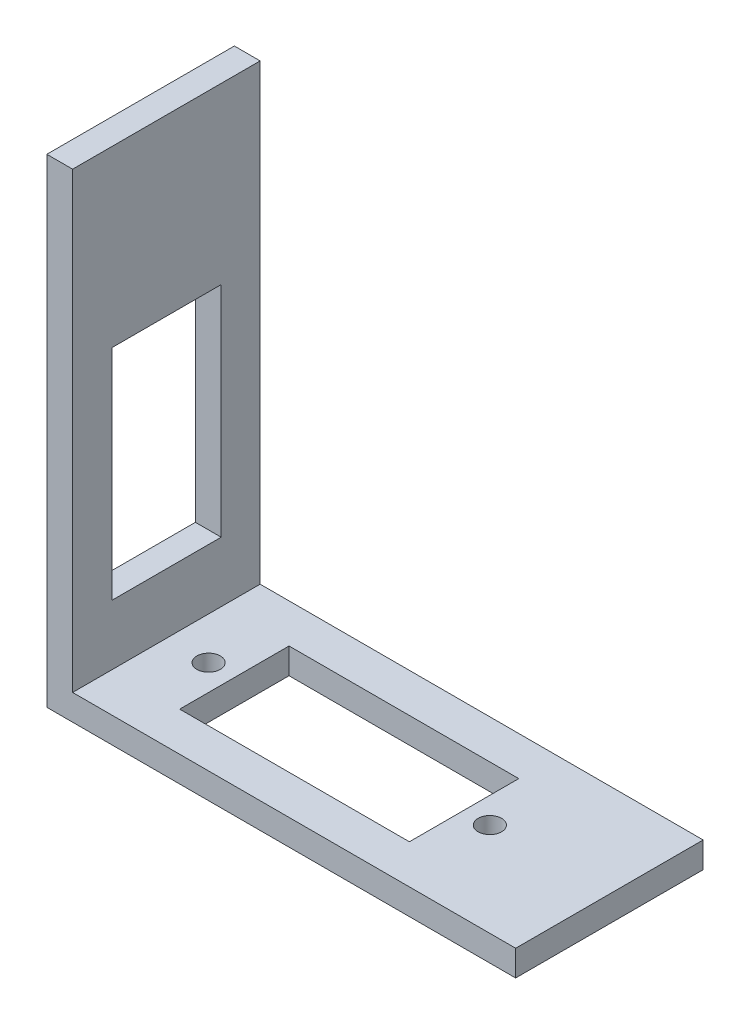
ISO-10303-21;
HEADER;
FILE_DESCRIPTION(('STEP AP214'),'2;1');
FILE_NAME('part.step','',(''),(''),'','','');
FILE_SCHEMA(('AUTOMOTIVE_DESIGN { 1 0 10303 214 1 1 1 1 }'));
ENDSEC;
DATA;
#1=APPLICATION_CONTEXT('core data for automotive mechanical design processes');
#2=APPLICATION_PROTOCOL_DEFINITION('international standard','automotive_design',2000,#1);
#3=PRODUCT_CONTEXT('',#1,'mechanical');
#4=PRODUCT('Part','Part','',(#3));
#5=PRODUCT_RELATED_PRODUCT_CATEGORY('part','',(#4));
#6=PRODUCT_DEFINITION_FORMATION('','',#4);
#7=PRODUCT_DEFINITION_CONTEXT('part definition',#1,'design');
#8=PRODUCT_DEFINITION('design','',#6,#7);
#9=PRODUCT_DEFINITION_SHAPE('','',#8);
#10=(LENGTH_UNIT() NAMED_UNIT(*) SI_UNIT(.MILLI.,.METRE.));
#11=(NAMED_UNIT(*) PLANE_ANGLE_UNIT() SI_UNIT($,.RADIAN.));
#12=(NAMED_UNIT(*) SI_UNIT($,.STERADIAN.) SOLID_ANGLE_UNIT());
#13=UNCERTAINTY_MEASURE_WITH_UNIT(LENGTH_MEASURE(1.E-05),#10,'distance_accuracy_value','');
#14=(GEOMETRIC_REPRESENTATION_CONTEXT(3) GLOBAL_UNCERTAINTY_ASSIGNED_CONTEXT((#13)) GLOBAL_UNIT_ASSIGNED_CONTEXT((#10,
#11,#12)) REPRESENTATION_CONTEXT('',''));
#15=CARTESIAN_POINT('',(0.,0.,0.));
#16=DIRECTION('',(0.,0.,1.));
#17=DIRECTION('',(1.,0.,0.));
#18=AXIS2_PLACEMENT_3D('',#15,#16,#17);
#19=CARTESIAN_POINT('',(0.,3.3,0.));
#20=DIRECTION('',(0.,-1.,0.));
#21=DIRECTION('',(0.,0.,-1.));
#22=AXIS2_PLACEMENT_3D('',#19,#20,#21);
#23=PLANE('',#22);
#24=DIRECTION('',(0.,0.,-1.));
#25=VECTOR('',#24,1.);
#26=CARTESIAN_POINT('',(-26.7,3.3,0.));
#27=LINE('',#26,#25);
#28=CARTESIAN_POINT('',(-26.7,3.3,12.));
#29=VERTEX_POINT('',#28);
#30=CARTESIAN_POINT('',(-26.7,3.3,-12.));
#31=VERTEX_POINT('',#30);
#32=EDGE_CURVE('E223',#29,#31,#27,.T.);
#33=ORIENTED_EDGE('',*,*,#32,.F.);
#34=DIRECTION('',(1.,0.,0.));
#35=VECTOR('',#34,1.);
#36=CARTESIAN_POINT('',(-30.,3.3,12.));
#37=LINE('',#36,#35);
#38=CARTESIAN_POINT('',(30.,3.3,12.));
#39=VERTEX_POINT('',#38);
#40=EDGE_CURVE('E233',#29,#39,#37,.T.);
#41=ORIENTED_EDGE('',*,*,#40,.T.);
#42=DIRECTION('',(0.,0.,-1.));
#43=VECTOR('',#42,1.);
#44=CARTESIAN_POINT('',(30.,3.3,12.));
#45=LINE('',#44,#43);
#46=CARTESIAN_POINT('',(30.,3.3,-12.));
#47=VERTEX_POINT('',#46);
#48=EDGE_CURVE('E227',#39,#47,#45,.T.);
#49=ORIENTED_EDGE('',*,*,#48,.T.);
#50=DIRECTION('',(-1.,0.,0.));
#51=VECTOR('',#50,1.);
#52=CARTESIAN_POINT('',(-30.,3.3,-12.));
#53=LINE('',#52,#51);
#54=EDGE_CURVE('E230',#47,#31,#53,.T.);
#55=ORIENTED_EDGE('',*,*,#54,.T.);
#56=EDGE_LOOP('',(#33,#41,#49,#55));
#57=FACE_BOUND('',#56,.T.);
#58=DIRECTION('',(1.,0.,0.));
#59=VECTOR('',#58,1.);
#60=CARTESIAN_POINT('',(11.4,3.3,-7.00000000000001));
#61=LINE('',#60,#59);
#62=CARTESIAN_POINT('',(-18.,3.3,-7.));
#63=VERTEX_POINT('',#62);
#64=CARTESIAN_POINT('',(11.4,3.3,-7.00000000000001));
#65=VERTEX_POINT('',#64);
#66=EDGE_CURVE('E179',#63,#65,#61,.T.);
#67=ORIENTED_EDGE('',*,*,#66,.T.);
#68=DIRECTION('',(0.,0.,1.));
#69=VECTOR('',#68,1.);
#70=CARTESIAN_POINT('',(11.4,3.3,-7.00000000000001));
#71=LINE('',#70,#69);
#72=CARTESIAN_POINT('',(11.4,3.3,6.99999999999999));
#73=VERTEX_POINT('',#72);
#74=EDGE_CURVE('E175',#65,#73,#71,.T.);
#75=ORIENTED_EDGE('',*,*,#74,.T.);
#76=DIRECTION('',(-1.,0.,0.));
#77=VECTOR('',#76,1.);
#78=CARTESIAN_POINT('',(11.4,3.3,6.99999999999999));
#79=LINE('',#78,#77);
#80=CARTESIAN_POINT('',(-18.,3.3,7.));
#81=VERTEX_POINT('',#80);
#82=EDGE_CURVE('E178',#73,#81,#79,.T.);
#83=ORIENTED_EDGE('',*,*,#82,.T.);
#84=DIRECTION('',(0.,0.,-1.));
#85=VECTOR('',#84,1.);
#86=CARTESIAN_POINT('',(-18.,3.3,-7.));
#87=LINE('',#86,#85);
#88=EDGE_CURVE('E182',#81,#63,#87,.T.);
#89=ORIENTED_EDGE('',*,*,#88,.T.);
#90=EDGE_LOOP('',(#67,#75,#83,#89));
#91=FACE_BOUND('',#90,.T.);
#92=CARTESIAN_POINT('',(-21.3,3.3,0.));
#93=DIRECTION('',(0.,-1.,0.));
#94=DIRECTION('',(0.,0.,-1.));
#95=AXIS2_PLACEMENT_3D('',#92,#93,#94);
#96=CIRCLE('',#95,1.5);
#97=CARTESIAN_POINT('',(-21.3,3.3,-1.5));
#98=VERTEX_POINT('',#97);
#99=EDGE_CURVE('E171',#98,#98,#96,.T.);
#100=ORIENTED_EDGE('',*,*,#99,.T.);
#101=EDGE_LOOP('',(#100));
#102=FACE_BOUND('',#101,.T.);
#103=CARTESIAN_POINT('',(14.7,3.3,0.));
#104=DIRECTION('',(0.,-1.,0.));
#105=DIRECTION('',(0.,0.,-1.));
#106=AXIS2_PLACEMENT_3D('',#103,#104,#105);
#107=CIRCLE('',#106,1.5);
#108=CARTESIAN_POINT('',(14.7,3.3,-1.50000000000001));
#109=VERTEX_POINT('',#108);
#110=EDGE_CURVE('E165',#109,#109,#107,.T.);
#111=ORIENTED_EDGE('',*,*,#110,.T.);
#112=EDGE_LOOP('',(#111));
#113=FACE_BOUND('',#112,.T.);
#114=ADVANCED_FACE('F33',(#57,#91,#102,#113),#23,.F.);
#115=CARTESIAN_POINT('',(0.,0.,0.));
#116=DIRECTION('',(0.,-1.,0.));
#117=DIRECTION('',(0.,0.,-1.));
#118=AXIS2_PLACEMENT_3D('',#115,#116,#117);
#119=PLANE('',#118);
#120=CARTESIAN_POINT('',(-21.3,0.,0.));
#121=DIRECTION('',(0.,1.,0.));
#122=DIRECTION('',(0.,0.,1.));
#123=AXIS2_PLACEMENT_3D('',#120,#121,#122);
#124=CIRCLE('',#123,1.5);
#125=CARTESIAN_POINT('',(-21.3,0.,1.5));
#126=VERTEX_POINT('',#125);
#127=EDGE_CURVE('E168',#126,#126,#124,.T.);
#128=ORIENTED_EDGE('',*,*,#127,.T.);
#129=EDGE_LOOP('',(#128));
#130=FACE_BOUND('',#129,.T.);
#131=DIRECTION('',(0.,0.,1.));
#132=VECTOR('',#131,1.);
#133=CARTESIAN_POINT('',(-30.,0.,12.));
#134=LINE('',#133,#132);
#135=CARTESIAN_POINT('',(-30.,0.,-12.));
#136=VERTEX_POINT('',#135);
#137=CARTESIAN_POINT('',(-30.,0.,12.));
#138=VERTEX_POINT('',#137);
#139=EDGE_CURVE('E240',#136,#138,#134,.T.);
#140=ORIENTED_EDGE('',*,*,#139,.F.);
#141=DIRECTION('',(-1.,0.,0.));
#142=VECTOR('',#141,1.);
#143=CARTESIAN_POINT('',(-30.,0.,-12.));
#144=LINE('',#143,#142);
#145=CARTESIAN_POINT('',(30.,0.,-12.));
#146=VERTEX_POINT('',#145);
#147=EDGE_CURVE('E238',#146,#136,#144,.T.);
#148=ORIENTED_EDGE('',*,*,#147,.F.);
#149=DIRECTION('',(0.,0.,-1.));
#150=VECTOR('',#149,1.);
#151=CARTESIAN_POINT('',(30.,0.,12.));
#152=LINE('',#151,#150);
#153=CARTESIAN_POINT('',(30.,0.,12.));
#154=VERTEX_POINT('',#153);
#155=EDGE_CURVE('E226',#154,#146,#152,.T.);
#156=ORIENTED_EDGE('',*,*,#155,.F.);
#157=DIRECTION('',(1.,0.,0.));
#158=VECTOR('',#157,1.);
#159=CARTESIAN_POINT('',(-30.,0.,12.));
#160=LINE('',#159,#158);
#161=EDGE_CURVE('E231',#138,#154,#160,.T.);
#162=ORIENTED_EDGE('',*,*,#161,.F.);
#163=EDGE_LOOP('',(#140,#148,#156,#162));
#164=FACE_BOUND('',#163,.T.);
#165=DIRECTION('',(0.,0.,-1.));
#166=VECTOR('',#165,1.);
#167=CARTESIAN_POINT('',(11.4,0.,-7.00000000000001));
#168=LINE('',#167,#166);
#169=CARTESIAN_POINT('',(11.4,0.,6.99999999999999));
#170=VERTEX_POINT('',#169);
#171=CARTESIAN_POINT('',(11.4,0.,-7.00000000000001));
#172=VERTEX_POINT('',#171);
#173=EDGE_CURVE('E191',#170,#172,#168,.T.);
#174=ORIENTED_EDGE('',*,*,#173,.T.);
#175=DIRECTION('',(-1.,0.,0.));
#176=VECTOR('',#175,1.);
#177=CARTESIAN_POINT('',(11.4,0.,-7.00000000000001));
#178=LINE('',#177,#176);
#179=CARTESIAN_POINT('',(-18.,0.,-7.));
#180=VERTEX_POINT('',#179);
#181=EDGE_CURVE('E194',#172,#180,#178,.T.);
#182=ORIENTED_EDGE('',*,*,#181,.T.);
#183=DIRECTION('',(0.,0.,1.));
#184=VECTOR('',#183,1.);
#185=CARTESIAN_POINT('',(-18.,0.,-7.));
#186=LINE('',#185,#184);
#187=CARTESIAN_POINT('',(-18.,0.,7.));
#188=VERTEX_POINT('',#187);
#189=EDGE_CURVE('E174',#180,#188,#186,.T.);
#190=ORIENTED_EDGE('',*,*,#189,.T.);
#191=DIRECTION('',(1.,0.,0.));
#192=VECTOR('',#191,1.);
#193=CARTESIAN_POINT('',(11.4,0.,6.99999999999999));
#194=LINE('',#193,#192);
#195=EDGE_CURVE('E188',#188,#170,#194,.T.);
#196=ORIENTED_EDGE('',*,*,#195,.T.);
#197=EDGE_LOOP('',(#174,#182,#190,#196));
#198=FACE_BOUND('',#197,.T.);
#199=CARTESIAN_POINT('',(14.7,0.,0.));
#200=DIRECTION('',(0.,1.,0.));
#201=DIRECTION('',(0.,0.,-1.));
#202=AXIS2_PLACEMENT_3D('',#199,#200,#201);
#203=CIRCLE('',#202,1.5);
#204=CARTESIAN_POINT('',(14.7,0.,-1.50000000000001));
#205=VERTEX_POINT('',#204);
#206=EDGE_CURVE('E160',#205,#205,#203,.T.);
#207=ORIENTED_EDGE('',*,*,#206,.T.);
#208=EDGE_LOOP('',(#207));
#209=FACE_BOUND('',#208,.T.);
#210=ADVANCED_FACE('F277',(#130,#164,#198,#209),#119,.T.);
#211=CARTESIAN_POINT('',(30.,3.3,12.));
#212=DIRECTION('',(-1.,0.,0.));
#213=DIRECTION('',(0.,0.,1.));
#214=AXIS2_PLACEMENT_3D('',#211,#212,#213);
#215=PLANE('',#214);
#216=ORIENTED_EDGE('',*,*,#155,.T.);
#217=DIRECTION('',(0.,-1.,0.));
#218=VECTOR('',#217,1.);
#219=CARTESIAN_POINT('',(30.,3.3,-12.));
#220=LINE('',#219,#218);
#221=EDGE_CURVE('E251',#47,#146,#220,.T.);
#222=ORIENTED_EDGE('',*,*,#221,.F.);
#223=ORIENTED_EDGE('',*,*,#48,.F.);
#224=DIRECTION('',(0.,-1.,0.));
#225=VECTOR('',#224,1.);
#226=CARTESIAN_POINT('',(30.,3.3,12.));
#227=LINE('',#226,#225);
#228=EDGE_CURVE('E235',#39,#154,#227,.T.);
#229=ORIENTED_EDGE('',*,*,#228,.T.);
#230=EDGE_LOOP('',(#216,#222,#223,#229));
#231=FACE_BOUND('',#230,.T.);
#232=ADVANCED_FACE('F35',(#231),#215,.F.);
#233=CARTESIAN_POINT('',(-30.,3.3,-12.));
#234=DIRECTION('',(0.,0.,1.));
#235=DIRECTION('',(1.,0.,0.));
#236=AXIS2_PLACEMENT_3D('',#233,#234,#235);
#237=PLANE('',#236);
#238=DIRECTION('',(0.,-1.,0.));
#239=VECTOR('',#238,1.);
#240=CARTESIAN_POINT('',(-30.,3.3,-12.));
#241=LINE('',#240,#239);
#242=CARTESIAN_POINT('',(-30.,61.3,-12.));
#243=VERTEX_POINT('',#242);
#244=EDGE_CURVE('E248',#243,#136,#241,.T.);
#245=ORIENTED_EDGE('',*,*,#244,.F.);
#246=DIRECTION('',(-1.,0.,0.));
#247=VECTOR('',#246,1.);
#248=CARTESIAN_POINT('',(-26.7,61.3,-12.));
#249=LINE('',#248,#247);
#250=CARTESIAN_POINT('',(-26.7,61.3,-12.));
#251=VERTEX_POINT('',#250);
#252=EDGE_CURVE('E185',#251,#243,#249,.T.);
#253=ORIENTED_EDGE('',*,*,#252,.F.);
#254=DIRECTION('',(0.,-1.,0.));
#255=VECTOR('',#254,1.);
#256=CARTESIAN_POINT('',(-26.7,61.3,-12.));
#257=LINE('',#256,#255);
#258=EDGE_CURVE('E217',#251,#31,#257,.T.);
#259=ORIENTED_EDGE('',*,*,#258,.T.);
#260=ORIENTED_EDGE('',*,*,#54,.F.);
#261=ORIENTED_EDGE('',*,*,#221,.T.);
#262=ORIENTED_EDGE('',*,*,#147,.T.);
#263=EDGE_LOOP('',(#245,#253,#259,#260,#261,#262));
#264=FACE_BOUND('',#263,.T.);
#265=ADVANCED_FACE('F294',(#264),#237,.F.);
#266=CARTESIAN_POINT('',(-30.,3.3,12.));
#267=DIRECTION('',(1.,0.,0.));
#268=DIRECTION('',(0.,0.,-1.));
#269=AXIS2_PLACEMENT_3D('',#266,#267,#268);
#270=PLANE('',#269);
#271=DIRECTION('',(0.,0.,1.));
#272=VECTOR('',#271,1.);
#273=CARTESIAN_POINT('',(-30.,11.,6.9872059416074));
#274=LINE('',#273,#272);
#275=CARTESIAN_POINT('',(-30.,11.,-7.0127940583926));
#276=VERTEX_POINT('',#275);
#277=CARTESIAN_POINT('',(-30.,11.,6.9872059416074));
#278=VERTEX_POINT('',#277);
#279=EDGE_CURVE('E146',#276,#278,#274,.T.);
#280=ORIENTED_EDGE('',*,*,#279,.F.);
#281=DIRECTION('',(0.,-1.,0.));
#282=VECTOR('',#281,1.);
#283=CARTESIAN_POINT('',(-30.,11.,-7.0127940583926));
#284=LINE('',#283,#282);
#285=CARTESIAN_POINT('',(-30.,39.,-7.0127940583926));
#286=VERTEX_POINT('',#285);
#287=EDGE_CURVE('E48',#286,#276,#284,.T.);
#288=ORIENTED_EDGE('',*,*,#287,.F.);
#289=DIRECTION('',(0.,0.,-1.));
#290=VECTOR('',#289,1.);
#291=CARTESIAN_POINT('',(-30.,39.,6.9872059416074));
#292=LINE('',#291,#290);
#293=CARTESIAN_POINT('',(-30.,39.,6.9872059416074));
#294=VERTEX_POINT('',#293);
#295=EDGE_CURVE('E153',#294,#286,#292,.T.);
#296=ORIENTED_EDGE('',*,*,#295,.F.);
#297=DIRECTION('',(0.,1.,0.));
#298=VECTOR('',#297,1.);
#299=CARTESIAN_POINT('',(-30.,11.,6.9872059416074));
#300=LINE('',#299,#298);
#301=EDGE_CURVE('E137',#278,#294,#300,.T.);
#302=ORIENTED_EDGE('',*,*,#301,.F.);
#303=EDGE_LOOP('',(#280,#288,#296,#302));
#304=FACE_BOUND('',#303,.T.);
#305=ORIENTED_EDGE('',*,*,#139,.T.);
#306=DIRECTION('',(0.,-1.,0.));
#307=VECTOR('',#306,1.);
#308=CARTESIAN_POINT('',(-30.,3.3,12.));
#309=LINE('',#308,#307);
#310=CARTESIAN_POINT('',(-30.,61.3,12.));
#311=VERTEX_POINT('',#310);
#312=EDGE_CURVE('E245',#311,#138,#309,.T.);
#313=ORIENTED_EDGE('',*,*,#312,.F.);
#314=DIRECTION('',(0.,0.,1.));
#315=VECTOR('',#314,1.);
#316=CARTESIAN_POINT('',(-30.,61.3,-12.));
#317=LINE('',#316,#315);
#318=EDGE_CURVE('E210',#243,#311,#317,.T.);
#319=ORIENTED_EDGE('',*,*,#318,.F.);
#320=ORIENTED_EDGE('',*,*,#244,.T.);
#321=EDGE_LOOP('',(#305,#313,#319,#320));
#322=FACE_BOUND('',#321,.T.);
#323=ADVANCED_FACE('F150',(#304,#322),#270,.F.);
#324=CARTESIAN_POINT('',(-30.,3.3,12.));
#325=DIRECTION('',(0.,0.,-1.));
#326=DIRECTION('',(-1.,0.,0.));
#327=AXIS2_PLACEMENT_3D('',#324,#325,#326);
#328=PLANE('',#327);
#329=ORIENTED_EDGE('',*,*,#161,.T.);
#330=ORIENTED_EDGE('',*,*,#228,.F.);
#331=ORIENTED_EDGE('',*,*,#40,.F.);
#332=DIRECTION('',(0.,-1.,0.));
#333=VECTOR('',#332,1.);
#334=CARTESIAN_POINT('',(-26.7,61.3,12.));
#335=LINE('',#334,#333);
#336=CARTESIAN_POINT('',(-26.7,61.3,12.));
#337=VERTEX_POINT('',#336);
#338=EDGE_CURVE('E220',#337,#29,#335,.T.);
#339=ORIENTED_EDGE('',*,*,#338,.F.);
#340=DIRECTION('',(1.,0.,0.));
#341=VECTOR('',#340,1.);
#342=CARTESIAN_POINT('',(-30.,61.3,12.));
#343=LINE('',#342,#341);
#344=EDGE_CURVE('E213',#311,#337,#343,.T.);
#345=ORIENTED_EDGE('',*,*,#344,.F.);
#346=ORIENTED_EDGE('',*,*,#312,.T.);
#347=EDGE_LOOP('',(#329,#330,#331,#339,#345,#346));
#348=FACE_BOUND('',#347,.T.);
#349=ADVANCED_FACE('F289',(#348),#328,.F.);
#350=CARTESIAN_POINT('',(-26.7,61.3,12.));
#351=DIRECTION('',(-1.,0.,0.));
#352=DIRECTION('',(0.,0.,1.));
#353=AXIS2_PLACEMENT_3D('',#350,#351,#352);
#354=PLANE('',#353);
#355=DIRECTION('',(0.,0.,-1.));
#356=VECTOR('',#355,1.);
#357=CARTESIAN_POINT('',(-26.7,39.,12.));
#358=LINE('',#357,#356);
#359=CARTESIAN_POINT('',(-26.7,39.,6.9872059416074));
#360=VERTEX_POINT('',#359);
#361=CARTESIAN_POINT('',(-26.7,39.,-7.0127940583926));
#362=VERTEX_POINT('',#361);
#363=EDGE_CURVE('E41',#360,#362,#358,.T.);
#364=ORIENTED_EDGE('',*,*,#363,.T.);
#365=DIRECTION('',(0.,-1.,0.));
#366=VECTOR('',#365,1.);
#367=CARTESIAN_POINT('',(-26.7,61.3,-7.0127940583926));
#368=LINE('',#367,#366);
#369=CARTESIAN_POINT('',(-26.7,11.,-7.0127940583926));
#370=VERTEX_POINT('',#369);
#371=EDGE_CURVE('E11',#362,#370,#368,.T.);
#372=ORIENTED_EDGE('',*,*,#371,.T.);
#373=DIRECTION('',(0.,0.,1.));
#374=VECTOR('',#373,1.);
#375=CARTESIAN_POINT('',(-26.7,11.,12.));
#376=LINE('',#375,#374);
#377=CARTESIAN_POINT('',(-26.7,11.,6.9872059416074));
#378=VERTEX_POINT('',#377);
#379=EDGE_CURVE('E254',#370,#378,#376,.T.);
#380=ORIENTED_EDGE('',*,*,#379,.T.);
#381=DIRECTION('',(0.,1.,0.));
#382=VECTOR('',#381,1.);
#383=CARTESIAN_POINT('',(-26.7,61.3,6.9872059416074));
#384=LINE('',#383,#382);
#385=EDGE_CURVE('E140',#378,#360,#384,.T.);
#386=ORIENTED_EDGE('',*,*,#385,.T.);
#387=EDGE_LOOP('',(#364,#372,#380,#386));
#388=FACE_BOUND('',#387,.T.);
#389=ORIENTED_EDGE('',*,*,#338,.T.);
#390=ORIENTED_EDGE('',*,*,#32,.T.);
#391=ORIENTED_EDGE('',*,*,#258,.F.);
#392=DIRECTION('',(0.,0.,-1.));
#393=VECTOR('',#392,1.);
#394=CARTESIAN_POINT('',(-26.7,61.3,12.));
#395=LINE('',#394,#393);
#396=EDGE_CURVE('E215',#337,#251,#395,.T.);
#397=ORIENTED_EDGE('',*,*,#396,.F.);
#398=EDGE_LOOP('',(#389,#390,#391,#397));
#399=FACE_BOUND('',#398,.T.);
#400=ADVANCED_FACE('F258',(#388,#399),#354,.F.);
#401=CARTESIAN_POINT('',(0.,61.3,0.));
#402=DIRECTION('',(0.,1.,0.));
#403=DIRECTION('',(0.,0.,1.));
#404=AXIS2_PLACEMENT_3D('',#401,#402,#403);
#405=PLANE('',#404);
#406=ORIENTED_EDGE('',*,*,#252,.T.);
#407=ORIENTED_EDGE('',*,*,#318,.T.);
#408=ORIENTED_EDGE('',*,*,#344,.T.);
#409=ORIENTED_EDGE('',*,*,#396,.T.);
#410=EDGE_LOOP('',(#406,#407,#408,#409));
#411=FACE_BOUND('',#410,.T.);
#412=ADVANCED_FACE('F306',(#411),#405,.T.);
#413=CARTESIAN_POINT('',(11.4,35.8631693789164,-7.00000000000001));
#414=DIRECTION('',(0.,0.,1.));
#415=DIRECTION('',(1.,0.,0.));
#416=AXIS2_PLACEMENT_3D('',#413,#414,#415);
#417=PLANE('',#416);
#418=DIRECTION('',(0.,-1.,0.));
#419=VECTOR('',#418,1.);
#420=CARTESIAN_POINT('',(-18.,35.8631693789164,-7.));
#421=LINE('',#420,#419);
#422=EDGE_CURVE('E197',#63,#180,#421,.T.);
#423=ORIENTED_EDGE('',*,*,#422,.T.);
#424=ORIENTED_EDGE('',*,*,#181,.F.);
#425=DIRECTION('',(0.,-1.,0.));
#426=VECTOR('',#425,1.);
#427=CARTESIAN_POINT('',(11.4,35.8631693789164,-7.00000000000001));
#428=LINE('',#427,#426);
#429=EDGE_CURVE('E199',#65,#172,#428,.T.);
#430=ORIENTED_EDGE('',*,*,#429,.F.);
#431=ORIENTED_EDGE('',*,*,#66,.F.);
#432=EDGE_LOOP('',(#423,#424,#430,#431));
#433=FACE_BOUND('',#432,.T.);
#434=ADVANCED_FACE('F329',(#433),#417,.T.);
#435=CARTESIAN_POINT('',(11.4,35.8631693789164,-7.00000000000001));
#436=DIRECTION('',(-1.,0.,0.));
#437=DIRECTION('',(0.,0.,1.));
#438=AXIS2_PLACEMENT_3D('',#435,#436,#437);
#439=PLANE('',#438);
#440=ORIENTED_EDGE('',*,*,#429,.T.);
#441=ORIENTED_EDGE('',*,*,#173,.F.);
#442=DIRECTION('',(0.,-1.,0.));
#443=VECTOR('',#442,1.);
#444=CARTESIAN_POINT('',(11.4,35.8631693789164,6.99999999999999));
#445=LINE('',#444,#443);
#446=EDGE_CURVE('E201',#73,#170,#445,.T.);
#447=ORIENTED_EDGE('',*,*,#446,.F.);
#448=ORIENTED_EDGE('',*,*,#74,.F.);
#449=EDGE_LOOP('',(#440,#441,#447,#448));
#450=FACE_BOUND('',#449,.T.);
#451=ADVANCED_FACE('F325',(#450),#439,.T.);
#452=CARTESIAN_POINT('',(11.4,35.8631693789164,6.99999999999999));
#453=DIRECTION('',(0.,0.,-1.));
#454=DIRECTION('',(-1.,0.,0.));
#455=AXIS2_PLACEMENT_3D('',#452,#453,#454);
#456=PLANE('',#455);
#457=ORIENTED_EDGE('',*,*,#446,.T.);
#458=ORIENTED_EDGE('',*,*,#195,.F.);
#459=DIRECTION('',(0.,-1.,0.));
#460=VECTOR('',#459,1.);
#461=CARTESIAN_POINT('',(-18.,35.8631693789164,7.));
#462=LINE('',#461,#460);
#463=EDGE_CURVE('E203',#81,#188,#462,.T.);
#464=ORIENTED_EDGE('',*,*,#463,.F.);
#465=ORIENTED_EDGE('',*,*,#82,.F.);
#466=EDGE_LOOP('',(#457,#458,#464,#465));
#467=FACE_BOUND('',#466,.T.);
#468=ADVANCED_FACE('F335',(#467),#456,.T.);
#469=CARTESIAN_POINT('',(-18.,35.8631693789164,-7.));
#470=DIRECTION('',(1.,0.,0.));
#471=DIRECTION('',(0.,0.,-1.));
#472=AXIS2_PLACEMENT_3D('',#469,#470,#471);
#473=PLANE('',#472);
#474=ORIENTED_EDGE('',*,*,#463,.T.);
#475=ORIENTED_EDGE('',*,*,#189,.F.);
#476=ORIENTED_EDGE('',*,*,#422,.F.);
#477=ORIENTED_EDGE('',*,*,#88,.F.);
#478=EDGE_LOOP('',(#474,#475,#476,#477));
#479=FACE_BOUND('',#478,.T.);
#480=ADVANCED_FACE('F332',(#479),#473,.T.);
#481=CARTESIAN_POINT('',(-21.3,35.8631693789164,0.));
#482=DIRECTION('',(0.,-1.,0.));
#483=DIRECTION('',(0.,0.,-1.));
#484=AXIS2_PLACEMENT_3D('',#481,#482,#483);
#485=CYLINDRICAL_SURFACE('',#484,1.5);
#486=ORIENTED_EDGE('',*,*,#99,.F.);
#487=EDGE_LOOP('',(#486));
#488=FACE_BOUND('',#487,.T.);
#489=ORIENTED_EDGE('',*,*,#127,.F.);
#490=EDGE_LOOP('',(#489));
#491=FACE_BOUND('',#490,.T.);
#492=ADVANCED_FACE('F272',(#488,#491),#485,.F.);
#493=CARTESIAN_POINT('',(14.7,35.8631693789164,0.));
#494=DIRECTION('',(0.,-1.,0.));
#495=DIRECTION('',(0.,0.,-1.));
#496=AXIS2_PLACEMENT_3D('',#493,#494,#495);
#497=CYLINDRICAL_SURFACE('',#496,1.5);
#498=ORIENTED_EDGE('',*,*,#110,.F.);
#499=EDGE_LOOP('',(#498));
#500=FACE_BOUND('',#499,.T.);
#501=ORIENTED_EDGE('',*,*,#206,.F.);
#502=EDGE_LOOP('',(#501));
#503=FACE_BOUND('',#502,.T.);
#504=ADVANCED_FACE('F265',(#500,#503),#497,.F.);
#505=CARTESIAN_POINT('',(-20.,11.,-7.0127940583926));
#506=DIRECTION('',(0.,0.,-1.));
#507=DIRECTION('',(-1.,0.,0.));
#508=AXIS2_PLACEMENT_3D('',#505,#506,#507);
#509=PLANE('',#508);
#510=DIRECTION('',(-1.,0.,0.));
#511=VECTOR('',#510,1.);
#512=CARTESIAN_POINT('',(-20.,39.,-7.0127940583926));
#513=LINE('',#512,#511);
#514=EDGE_CURVE('E158',#362,#286,#513,.T.);
#515=ORIENTED_EDGE('',*,*,#514,.T.);
#516=ORIENTED_EDGE('',*,*,#287,.T.);
#517=DIRECTION('',(-1.,0.,0.));
#518=VECTOR('',#517,1.);
#519=CARTESIAN_POINT('',(-20.,11.,-7.0127940583926));
#520=LINE('',#519,#518);
#521=EDGE_CURVE('E143',#370,#276,#520,.T.);
#522=ORIENTED_EDGE('',*,*,#521,.F.);
#523=ORIENTED_EDGE('',*,*,#371,.F.);
#524=EDGE_LOOP('',(#515,#516,#522,#523));
#525=FACE_BOUND('',#524,.T.);
#526=ADVANCED_FACE('F263',(#525),#509,.F.);
#527=CARTESIAN_POINT('',(-20.,39.,6.9872059416074));
#528=DIRECTION('',(0.,1.,0.));
#529=DIRECTION('',(0.,0.,1.));
#530=AXIS2_PLACEMENT_3D('',#527,#528,#529);
#531=PLANE('',#530);
#532=DIRECTION('',(-1.,0.,0.));
#533=VECTOR('',#532,1.);
#534=CARTESIAN_POINT('',(-20.,39.,6.9872059416074));
#535=LINE('',#534,#533);
#536=EDGE_CURVE('E142',#360,#294,#535,.T.);
#537=ORIENTED_EDGE('',*,*,#536,.T.);
#538=ORIENTED_EDGE('',*,*,#295,.T.);
#539=ORIENTED_EDGE('',*,*,#514,.F.);
#540=ORIENTED_EDGE('',*,*,#363,.F.);
#541=EDGE_LOOP('',(#537,#538,#539,#540));
#542=FACE_BOUND('',#541,.T.);
#543=ADVANCED_FACE('F262',(#542),#531,.F.);
#544=CARTESIAN_POINT('',(-20.,11.,6.9872059416074));
#545=DIRECTION('',(0.,0.,1.));
#546=DIRECTION('',(1.,0.,0.));
#547=AXIS2_PLACEMENT_3D('',#544,#545,#546);
#548=PLANE('',#547);
#549=DIRECTION('',(-1.,0.,0.));
#550=VECTOR('',#549,1.);
#551=CARTESIAN_POINT('',(-20.,11.,6.9872059416074));
#552=LINE('',#551,#550);
#553=EDGE_CURVE('E56',#378,#278,#552,.T.);
#554=ORIENTED_EDGE('',*,*,#553,.T.);
#555=ORIENTED_EDGE('',*,*,#301,.T.);
#556=ORIENTED_EDGE('',*,*,#536,.F.);
#557=ORIENTED_EDGE('',*,*,#385,.F.);
#558=EDGE_LOOP('',(#554,#555,#556,#557));
#559=FACE_BOUND('',#558,.T.);
#560=ADVANCED_FACE('F134',(#559),#548,.F.);
#561=CARTESIAN_POINT('',(-20.,11.,6.9872059416074));
#562=DIRECTION('',(0.,-1.,0.));
#563=DIRECTION('',(0.,0.,-1.));
#564=AXIS2_PLACEMENT_3D('',#561,#562,#563);
#565=PLANE('',#564);
#566=ORIENTED_EDGE('',*,*,#521,.T.);
#567=ORIENTED_EDGE('',*,*,#279,.T.);
#568=ORIENTED_EDGE('',*,*,#553,.F.);
#569=ORIENTED_EDGE('',*,*,#379,.F.);
#570=EDGE_LOOP('',(#566,#567,#568,#569));
#571=FACE_BOUND('',#570,.T.);
#572=ADVANCED_FACE('F147',(#571),#565,.F.);
#573=CLOSED_SHELL('',(#114,#210,#232,#265,#323,#349,#400,#412,#434,#451,#468,#480,#492,#504,
#526,#543,#560,#572));
#574=MANIFOLD_SOLID_BREP('B2',#573);
#575=ADVANCED_BREP_SHAPE_REPRESENTATION('',(#18,#574),#14);
#576=SHAPE_DEFINITION_REPRESENTATION(#9,#575);
ENDSEC;
END-ISO-10303-21;
